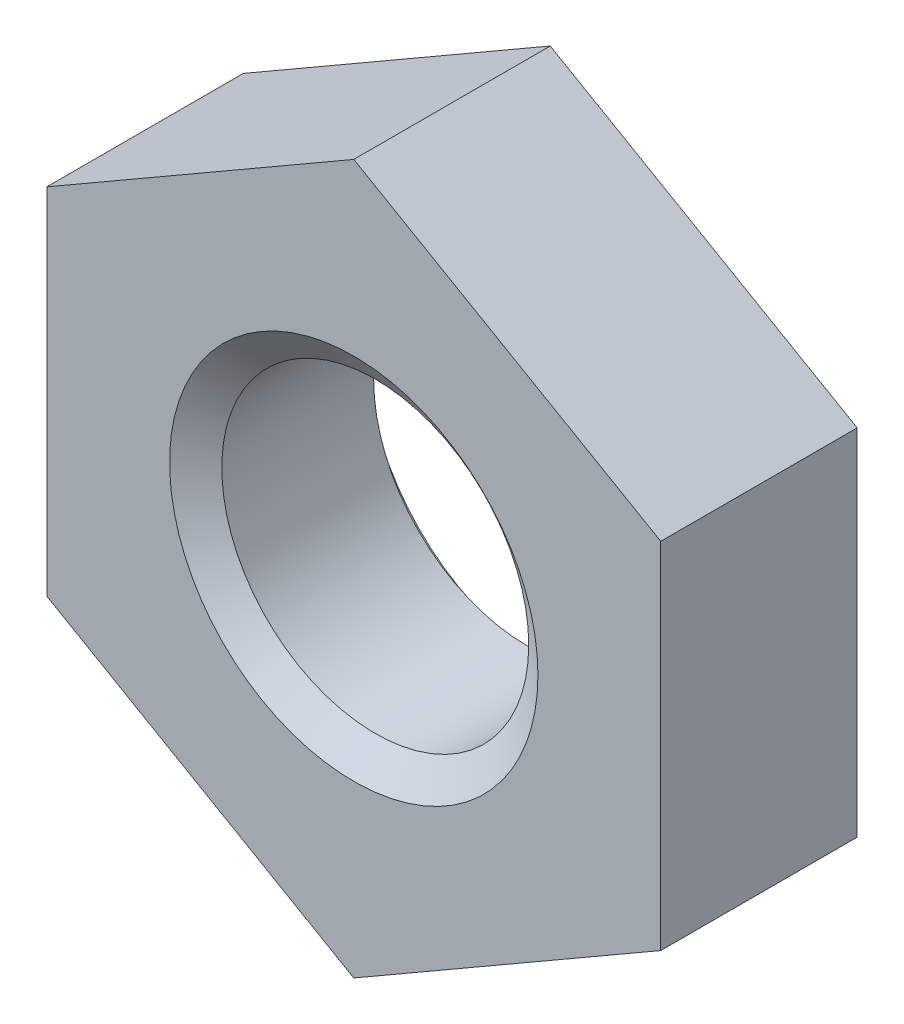
ISO-10303-21;
HEADER;
FILE_DESCRIPTION(('STEP AP214'),'2;1');
FILE_NAME('part.step','',(''),(''),'','','');
FILE_SCHEMA(('AUTOMOTIVE_DESIGN { 1 0 10303 214 1 1 1 1 }'));
ENDSEC;
DATA;
#1=APPLICATION_CONTEXT('core data for automotive mechanical design processes');
#2=APPLICATION_PROTOCOL_DEFINITION('international standard','automotive_design',2000,#1);
#3=PRODUCT_CONTEXT('',#1,'mechanical');
#4=PRODUCT('Part','Part','',(#3));
#5=PRODUCT_RELATED_PRODUCT_CATEGORY('part','',(#4));
#6=PRODUCT_DEFINITION_FORMATION('','',#4);
#7=PRODUCT_DEFINITION_CONTEXT('part definition',#1,'design');
#8=PRODUCT_DEFINITION('design','',#6,#7);
#9=PRODUCT_DEFINITION_SHAPE('','',#8);
#10=(LENGTH_UNIT() NAMED_UNIT(*) SI_UNIT(.MILLI.,.METRE.));
#11=(NAMED_UNIT(*) PLANE_ANGLE_UNIT() SI_UNIT($,.RADIAN.));
#12=(NAMED_UNIT(*) SI_UNIT($,.STERADIAN.) SOLID_ANGLE_UNIT());
#13=UNCERTAINTY_MEASURE_WITH_UNIT(LENGTH_MEASURE(1.E-05),#10,'distance_accuracy_value','');
#14=(GEOMETRIC_REPRESENTATION_CONTEXT(3) GLOBAL_UNCERTAINTY_ASSIGNED_CONTEXT((#13)) GLOBAL_UNIT_ASSIGNED_CONTEXT((#10,
#11,#12)) REPRESENTATION_CONTEXT('',''));
#15=CARTESIAN_POINT('',(0.,0.,0.));
#16=DIRECTION('',(0.,0.,1.));
#17=DIRECTION('',(1.,0.,0.));
#18=AXIS2_PLACEMENT_3D('',#15,#16,#17);
#19=CARTESIAN_POINT('',(0.,0.,-3.2));
#20=DIRECTION('',(0.,0.,1.));
#21=DIRECTION('',(1.,0.,0.));
#22=AXIS2_PLACEMENT_3D('',#19,#20,#21);
#23=CYLINDRICAL_SURFACE('',#22,2.5);
#24=CARTESIAN_POINT('',(0.,0.,-0.35010376910485));
#25=DIRECTION('',(0.,0.,1.));
#26=DIRECTION('',(1.,0.,0.));
#27=AXIS2_PLACEMENT_3D('',#24,#25,#26);
#28=CIRCLE('',#27,2.5);
#29=CARTESIAN_POINT('',(2.5,0.,-0.35010376910485));
#30=VERTEX_POINT('',#29);
#31=EDGE_CURVE('E122',#30,#30,#28,.F.);
#32=ORIENTED_EDGE('',*,*,#31,.F.);
#33=EDGE_LOOP('',(#32));
#34=FACE_BOUND('',#33,.T.);
#35=CARTESIAN_POINT('',(0.,0.,-2.82449623089514));
#36=DIRECTION('',(0.,0.,-1.));
#37=DIRECTION('',(-1.,0.,0.));
#38=AXIS2_PLACEMENT_3D('',#35,#36,#37);
#39=CIRCLE('',#38,2.5);
#40=CARTESIAN_POINT('',(-2.5,0.,-2.82449623089514));
#41=VERTEX_POINT('',#40);
#42=EDGE_CURVE('E34',#41,#41,#39,.F.);
#43=ORIENTED_EDGE('',*,*,#42,.F.);
#44=EDGE_LOOP('',(#43));
#45=FACE_BOUND('',#44,.T.);
#46=ADVANCED_FACE('F30',(#34,#45),#23,.F.);
#47=CARTESIAN_POINT('',(-9.99999999999997,0.,-3.2));
#48=DIRECTION('',(0.,0.,1.));
#49=DIRECTION('',(1.,0.,0.));
#50=AXIS2_PLACEMENT_3D('',#47,#48,#49);
#51=PLANE('',#50);
#52=DIRECTION('',(-0.866025403784436,-0.500000000000004,0.));
#53=VECTOR('',#52,1.);
#54=CARTESIAN_POINT('',(0.,5.77350269189627,-3.2));
#55=LINE('',#54,#53);
#56=CARTESIAN_POINT('',(0.,5.77350269189627,-3.2));
#57=VERTEX_POINT('',#56);
#58=CARTESIAN_POINT('',(-5.,2.88675134594811,-3.2));
#59=VERTEX_POINT('',#58);
#60=EDGE_CURVE('E133',#57,#59,#55,.T.);
#61=ORIENTED_EDGE('',*,*,#60,.F.);
#62=DIRECTION('',(-0.866025403784437,0.500000000000003,0.));
#63=VECTOR('',#62,1.);
#64=CARTESIAN_POINT('',(5.,2.88675134594812,-3.2));
#65=LINE('',#64,#63);
#66=CARTESIAN_POINT('',(5.,2.88675134594812,-3.2));
#67=VERTEX_POINT('',#66);
#68=EDGE_CURVE('E100',#67,#57,#65,.T.);
#69=ORIENTED_EDGE('',*,*,#68,.F.);
#70=DIRECTION('',(0.,-1.,0.));
#71=VECTOR('',#70,1.);
#72=CARTESIAN_POINT('',(5.,2.88675134594812,-3.2));
#73=LINE('',#72,#71);
#74=CARTESIAN_POINT('',(5.,-2.88675134594816,-3.2));
#75=VERTEX_POINT('',#74);
#76=EDGE_CURVE('E92',#67,#75,#73,.T.);
#77=ORIENTED_EDGE('',*,*,#76,.T.);
#78=DIRECTION('',(0.866025403784436,0.500000000000005,0.));
#79=VECTOR('',#78,1.);
#80=CARTESIAN_POINT('',(0.,-5.77350269189632,-3.2));
#81=LINE('',#80,#79);
#82=CARTESIAN_POINT('',(0.,-5.77350269189632,-3.2));
#83=VERTEX_POINT('',#82);
#84=EDGE_CURVE('E98',#83,#75,#81,.T.);
#85=ORIENTED_EDGE('',*,*,#84,.F.);
#86=DIRECTION('',(0.866025403784437,-0.500000000000003,0.));
#87=VECTOR('',#86,1.);
#88=CARTESIAN_POINT('',(-5.,-2.88675134594816,-3.2));
#89=LINE('',#88,#87);
#90=CARTESIAN_POINT('',(-5.,-2.88675134594816,-3.2));
#91=VERTEX_POINT('',#90);
#92=EDGE_CURVE('E111',#91,#83,#89,.T.);
#93=ORIENTED_EDGE('',*,*,#92,.F.);
#94=DIRECTION('',(0.,-1.,0.));
#95=VECTOR('',#94,1.);
#96=CARTESIAN_POINT('',(-5.,2.88675134594811,-3.2));
#97=LINE('',#96,#95);
#98=EDGE_CURVE('E113',#59,#91,#97,.T.);
#99=ORIENTED_EDGE('',*,*,#98,.F.);
#100=EDGE_LOOP('',(#61,#69,#77,#85,#93,#99));
#101=FACE_BOUND('',#100,.T.);
#102=CARTESIAN_POINT('',(0.,0.,-3.2));
#103=DIRECTION('',(0.,0.,1.));
#104=DIRECTION('',(1.,0.,0.));
#105=AXIS2_PLACEMENT_3D('',#102,#103,#104);
#106=CIRCLE('',#105,3.);
#107=CARTESIAN_POINT('',(3.,0.,-3.2));
#108=VERTEX_POINT('',#107);
#109=EDGE_CURVE('E142',#108,#108,#106,.F.);
#110=ORIENTED_EDGE('',*,*,#109,.F.);
#111=EDGE_LOOP('',(#110));
#112=FACE_BOUND('',#111,.T.);
#113=ADVANCED_FACE('F94',(#101,#112),#51,.F.);
#114=CARTESIAN_POINT('',(-9.99999999999997,0.,0.));
#115=DIRECTION('',(0.,0.,1.));
#116=DIRECTION('',(1.,0.,0.));
#117=AXIS2_PLACEMENT_3D('',#114,#115,#116);
#118=PLANE('',#117);
#119=DIRECTION('',(-0.866025403784436,-0.500000000000004,0.));
#120=VECTOR('',#119,1.);
#121=CARTESIAN_POINT('',(0.,5.77350269189627,0.));
#122=LINE('',#121,#120);
#123=CARTESIAN_POINT('',(0.,5.77350269189627,0.));
#124=VERTEX_POINT('',#123);
#125=CARTESIAN_POINT('',(-5.,2.88675134594811,0.));
#126=VERTEX_POINT('',#125);
#127=EDGE_CURVE('E118',#124,#126,#122,.T.);
#128=ORIENTED_EDGE('',*,*,#127,.T.);
#129=DIRECTION('',(0.,-1.,0.));
#130=VECTOR('',#129,1.);
#131=CARTESIAN_POINT('',(-5.,2.88675134594811,0.));
#132=LINE('',#131,#130);
#133=CARTESIAN_POINT('',(-5.,-2.88675134594816,0.));
#134=VERTEX_POINT('',#133);
#135=EDGE_CURVE('E121',#126,#134,#132,.T.);
#136=ORIENTED_EDGE('',*,*,#135,.T.);
#137=DIRECTION('',(0.866025403784437,-0.500000000000003,0.));
#138=VECTOR('',#137,1.);
#139=CARTESIAN_POINT('',(-5.,-2.88675134594816,0.));
#140=LINE('',#139,#138);
#141=CARTESIAN_POINT('',(0.,-5.77350269189632,0.));
#142=VERTEX_POINT('',#141);
#143=EDGE_CURVE('E125',#134,#142,#140,.T.);
#144=ORIENTED_EDGE('',*,*,#143,.T.);
#145=DIRECTION('',(0.866025403784436,0.500000000000005,0.));
#146=VECTOR('',#145,1.);
#147=CARTESIAN_POINT('',(0.,-5.77350269189632,0.));
#148=LINE('',#147,#146);
#149=CARTESIAN_POINT('',(5.,-2.88675134594816,0.));
#150=VERTEX_POINT('',#149);
#151=EDGE_CURVE('E128',#142,#150,#148,.T.);
#152=ORIENTED_EDGE('',*,*,#151,.T.);
#153=DIRECTION('',(0.,-1.,0.));
#154=VECTOR('',#153,1.);
#155=CARTESIAN_POINT('',(5.,2.88675134594812,0.));
#156=LINE('',#155,#154);
#157=CARTESIAN_POINT('',(5.,2.88675134594812,0.));
#158=VERTEX_POINT('',#157);
#159=EDGE_CURVE('E104',#158,#150,#156,.T.);
#160=ORIENTED_EDGE('',*,*,#159,.F.);
#161=DIRECTION('',(-0.866025403784437,0.500000000000003,0.));
#162=VECTOR('',#161,1.);
#163=CARTESIAN_POINT('',(5.,2.88675134594812,0.));
#164=LINE('',#163,#162);
#165=EDGE_CURVE('E131',#158,#124,#164,.T.);
#166=ORIENTED_EDGE('',*,*,#165,.T.);
#167=EDGE_LOOP('',(#128,#136,#144,#152,#160,#166));
#168=FACE_BOUND('',#167,.T.);
#169=CARTESIAN_POINT('',(0.,0.,0.));
#170=DIRECTION('',(0.,0.,1.));
#171=DIRECTION('',(1.,0.,0.));
#172=AXIS2_PLACEMENT_3D('',#169,#170,#171);
#173=CIRCLE('',#172,3.);
#174=CARTESIAN_POINT('',(3.,0.,0.));
#175=VERTEX_POINT('',#174);
#176=EDGE_CURVE('E141',#175,#175,#173,.T.);
#177=ORIENTED_EDGE('',*,*,#176,.F.);
#178=EDGE_LOOP('',(#177));
#179=FACE_BOUND('',#178,.T.);
#180=ADVANCED_FACE('F158',(#168,#179),#118,.T.);
#181=CARTESIAN_POINT('',(0.,5.77350269189627,-3.2));
#182=DIRECTION('',(-0.500000000000004,0.866025403784436,0.));
#183=DIRECTION('',(-0.866025403784436,-0.500000000000004,0.));
#184=AXIS2_PLACEMENT_3D('',#181,#182,#183);
#185=PLANE('',#184);
#186=ORIENTED_EDGE('',*,*,#127,.F.);
#187=DIRECTION('',(0.,0.,1.));
#188=VECTOR('',#187,1.);
#189=CARTESIAN_POINT('',(0.,5.77350269189627,-3.2));
#190=LINE('',#189,#188);
#191=EDGE_CURVE('E11',#57,#124,#190,.T.);
#192=ORIENTED_EDGE('',*,*,#191,.F.);
#193=ORIENTED_EDGE('',*,*,#60,.T.);
#194=DIRECTION('',(0.,0.,1.));
#195=VECTOR('',#194,1.);
#196=CARTESIAN_POINT('',(-5.,2.88675134594811,-3.2));
#197=LINE('',#196,#195);
#198=EDGE_CURVE('E81',#59,#126,#197,.T.);
#199=ORIENTED_EDGE('',*,*,#198,.T.);
#200=EDGE_LOOP('',(#186,#192,#193,#199));
#201=FACE_BOUND('',#200,.T.);
#202=ADVANCED_FACE('F32',(#201),#185,.T.);
#203=CARTESIAN_POINT('',(5.,2.88675134594812,-3.2));
#204=DIRECTION('',(0.500000000000003,0.866025403784437,0.));
#205=DIRECTION('',(-0.866025403784437,0.500000000000003,0.));
#206=AXIS2_PLACEMENT_3D('',#203,#204,#205);
#207=PLANE('',#206);
#208=ORIENTED_EDGE('',*,*,#165,.F.);
#209=DIRECTION('',(0.,0.,1.));
#210=VECTOR('',#209,1.);
#211=CARTESIAN_POINT('',(5.,2.88675134594812,-3.2));
#212=LINE('',#211,#210);
#213=EDGE_CURVE('E40',#67,#158,#212,.T.);
#214=ORIENTED_EDGE('',*,*,#213,.F.);
#215=ORIENTED_EDGE('',*,*,#68,.T.);
#216=ORIENTED_EDGE('',*,*,#191,.T.);
#217=EDGE_LOOP('',(#208,#214,#215,#216));
#218=FACE_BOUND('',#217,.T.);
#219=ADVANCED_FACE('F160',(#218),#207,.T.);
#220=CARTESIAN_POINT('',(5.,2.88675134594812,-3.2));
#221=DIRECTION('',(-1.,0.,0.));
#222=DIRECTION('',(0.,0.,1.));
#223=AXIS2_PLACEMENT_3D('',#220,#221,#222);
#224=PLANE('',#223);
#225=ORIENTED_EDGE('',*,*,#159,.T.);
#226=DIRECTION('',(0.,0.,1.));
#227=VECTOR('',#226,1.);
#228=CARTESIAN_POINT('',(5.,-2.88675134594816,-3.2));
#229=LINE('',#228,#227);
#230=EDGE_CURVE('E102',#75,#150,#229,.T.);
#231=ORIENTED_EDGE('',*,*,#230,.F.);
#232=ORIENTED_EDGE('',*,*,#76,.F.);
#233=ORIENTED_EDGE('',*,*,#213,.T.);
#234=EDGE_LOOP('',(#225,#231,#232,#233));
#235=FACE_BOUND('',#234,.T.);
#236=ADVANCED_FACE('F103',(#235),#224,.F.);
#237=CARTESIAN_POINT('',(0.,-5.77350269189632,-3.2));
#238=DIRECTION('',(0.500000000000005,-0.866025403784436,0.));
#239=DIRECTION('',(0.866025403784436,0.500000000000005,0.));
#240=AXIS2_PLACEMENT_3D('',#237,#238,#239);
#241=PLANE('',#240);
#242=ORIENTED_EDGE('',*,*,#151,.F.);
#243=DIRECTION('',(0.,0.,1.));
#244=VECTOR('',#243,1.);
#245=CARTESIAN_POINT('',(0.,-5.77350269189632,-3.2));
#246=LINE('',#245,#244);
#247=EDGE_CURVE('E108',#83,#142,#246,.T.);
#248=ORIENTED_EDGE('',*,*,#247,.F.);
#249=ORIENTED_EDGE('',*,*,#84,.T.);
#250=ORIENTED_EDGE('',*,*,#230,.T.);
#251=EDGE_LOOP('',(#242,#248,#249,#250));
#252=FACE_BOUND('',#251,.T.);
#253=ADVANCED_FACE('F110',(#252),#241,.T.);
#254=CARTESIAN_POINT('',(-5.,-2.88675134594816,-3.2));
#255=DIRECTION('',(-0.500000000000003,-0.866025403784437,0.));
#256=DIRECTION('',(0.866025403784437,-0.500000000000003,0.));
#257=AXIS2_PLACEMENT_3D('',#254,#255,#256);
#258=PLANE('',#257);
#259=ORIENTED_EDGE('',*,*,#143,.F.);
#260=DIRECTION('',(0.,0.,1.));
#261=VECTOR('',#260,1.);
#262=CARTESIAN_POINT('',(-5.,-2.88675134594816,-3.2));
#263=LINE('',#262,#261);
#264=EDGE_CURVE('E137',#91,#134,#263,.T.);
#265=ORIENTED_EDGE('',*,*,#264,.F.);
#266=ORIENTED_EDGE('',*,*,#92,.T.);
#267=ORIENTED_EDGE('',*,*,#247,.T.);
#268=EDGE_LOOP('',(#259,#265,#266,#267));
#269=FACE_BOUND('',#268,.T.);
#270=ADVANCED_FACE('F210',(#269),#258,.T.);
#271=CARTESIAN_POINT('',(-5.,2.88675134594811,-3.2));
#272=DIRECTION('',(-1.,0.,0.));
#273=DIRECTION('',(0.,0.,1.));
#274=AXIS2_PLACEMENT_3D('',#271,#272,#273);
#275=PLANE('',#274);
#276=ORIENTED_EDGE('',*,*,#135,.F.);
#277=ORIENTED_EDGE('',*,*,#198,.F.);
#278=ORIENTED_EDGE('',*,*,#98,.T.);
#279=ORIENTED_EDGE('',*,*,#264,.T.);
#280=EDGE_LOOP('',(#276,#277,#278,#279));
#281=FACE_BOUND('',#280,.T.);
#282=ADVANCED_FACE('F155',(#281),#275,.T.);
#283=CARTESIAN_POINT('',(0.,0.,-0.385114146015334));
#284=DIRECTION('',(0.,0.,1.));
#285=DIRECTION('',(1.,0.,0.));
#286=AXIS2_PLACEMENT_3D('',#283,#284,#285);
#287=CONICAL_SURFACE('',#286,2.45,0.959931088596883);
#288=ORIENTED_EDGE('',*,*,#176,.T.);
#289=EDGE_LOOP('',(#288));
#290=FACE_BOUND('',#289,.T.);
#291=ORIENTED_EDGE('',*,*,#31,.T.);
#292=EDGE_LOOP('',(#291));
#293=FACE_BOUND('',#292,.T.);
#294=ADVANCED_FACE('F179',(#290,#293),#287,.F.);
#295=CARTESIAN_POINT('',(0.,0.,-3.1746));
#296=DIRECTION('',(0.,0.,-1.));
#297=DIRECTION('',(-1.,0.,0.));
#298=AXIS2_PLACEMENT_3D('',#295,#296,#297);
#299=CONICAL_SURFACE('',#298,3.,0.959931088596883);
#300=CARTESIAN_POINT('',(0.,0.,-3.1746));
#301=DIRECTION('',(0.,0.,1.));
#302=DIRECTION('',(1.,0.,0.));
#303=AXIS2_PLACEMENT_3D('',#300,#301,#302);
#304=CIRCLE('',#303,3.);
#305=CARTESIAN_POINT('',(3.,0.,-3.1746));
#306=VERTEX_POINT('',#305);
#307=EDGE_CURVE('E144',#306,#306,#304,.T.);
#308=ORIENTED_EDGE('',*,*,#307,.F.);
#309=EDGE_LOOP('',(#308));
#310=FACE_BOUND('',#309,.T.);
#311=ORIENTED_EDGE('',*,*,#42,.T.);
#312=EDGE_LOOP('',(#311));
#313=FACE_BOUND('',#312,.T.);
#314=ADVANCED_FACE('F245',(#310,#313),#299,.F.);
#315=CARTESIAN_POINT('',(0.,0.,-25.0375057290932));
#316=DIRECTION('',(0.,0.,1.));
#317=DIRECTION('',(1.,0.,0.));
#318=AXIS2_PLACEMENT_3D('',#315,#316,#317);
#319=CYLINDRICAL_SURFACE('',#318,3.);
#320=ORIENTED_EDGE('',*,*,#307,.T.);
#321=EDGE_LOOP('',(#320));
#322=FACE_BOUND('',#321,.T.);
#323=ORIENTED_EDGE('',*,*,#109,.T.);
#324=EDGE_LOOP('',(#323));
#325=FACE_BOUND('',#324,.T.);
#326=ADVANCED_FACE('F253',(#322,#325),#319,.F.);
#327=CLOSED_SHELL('',(#46,#113,#180,#202,#219,#236,#253,#270,#282,#294,#314,#326));
#328=MANIFOLD_SOLID_BREP('B2',#327);
#329=ADVANCED_BREP_SHAPE_REPRESENTATION('',(#18,#328),#14);
#330=SHAPE_DEFINITION_REPRESENTATION(#9,#329);
ENDSEC;
END-ISO-10303-21;
